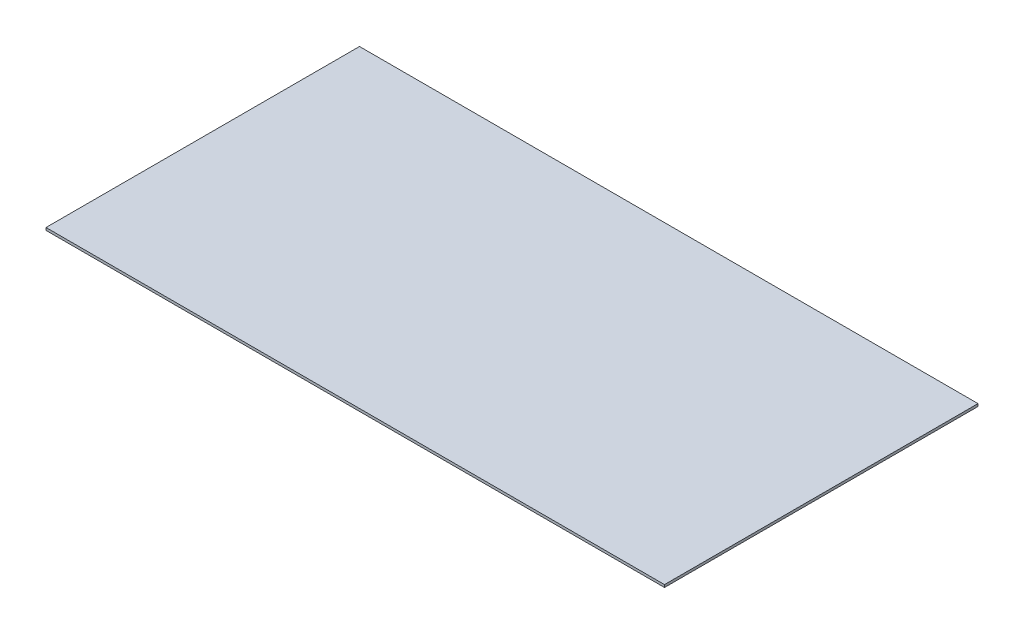
ISO-10303-21;
HEADER;
FILE_DESCRIPTION(('STEP AP214'),'2;1');
FILE_NAME('part.step','',(''),(''),'','','');
FILE_SCHEMA(('AUTOMOTIVE_DESIGN { 1 0 10303 214 1 1 1 1 }'));
ENDSEC;
DATA;
#1=APPLICATION_CONTEXT('core data for automotive mechanical design processes');
#2=APPLICATION_PROTOCOL_DEFINITION('international standard','automotive_design',2000,#1);
#3=PRODUCT_CONTEXT('',#1,'mechanical');
#4=PRODUCT('Part','Part','',(#3));
#5=PRODUCT_RELATED_PRODUCT_CATEGORY('part','',(#4));
#6=PRODUCT_DEFINITION_FORMATION('','',#4);
#7=PRODUCT_DEFINITION_CONTEXT('part definition',#1,'design');
#8=PRODUCT_DEFINITION('design','',#6,#7);
#9=PRODUCT_DEFINITION_SHAPE('','',#8);
#10=(LENGTH_UNIT() NAMED_UNIT(*) SI_UNIT(.MILLI.,.METRE.));
#11=(NAMED_UNIT(*) PLANE_ANGLE_UNIT() SI_UNIT($,.RADIAN.));
#12=(NAMED_UNIT(*) SI_UNIT($,.STERADIAN.) SOLID_ANGLE_UNIT());
#13=UNCERTAINTY_MEASURE_WITH_UNIT(LENGTH_MEASURE(1.E-05),#10,'distance_accuracy_value','');
#14=(GEOMETRIC_REPRESENTATION_CONTEXT(3) GLOBAL_UNCERTAINTY_ASSIGNED_CONTEXT((#13)) GLOBAL_UNIT_ASSIGNED_CONTEXT((#10,
#11,#12)) REPRESENTATION_CONTEXT('',''));
#15=CARTESIAN_POINT('',(0.,0.,0.));
#16=DIRECTION('',(0.,0.,1.));
#17=DIRECTION('',(1.,0.,0.));
#18=AXIS2_PLACEMENT_3D('',#15,#16,#17);
#19=CARTESIAN_POINT('',(365.,3.,185.));
#20=DIRECTION('',(-1.,0.,0.));
#21=DIRECTION('',(0.,0.,1.));
#22=AXIS2_PLACEMENT_3D('',#19,#20,#21);
#23=PLANE('',#22);
#24=DIRECTION('',(0.,0.,-1.));
#25=VECTOR('',#24,1.);
#26=CARTESIAN_POINT('',(365.,0.,185.));
#27=LINE('',#26,#25);
#28=CARTESIAN_POINT('',(365.,0.,185.));
#29=VERTEX_POINT('',#28);
#30=CARTESIAN_POINT('',(365.,0.,-185.));
#31=VERTEX_POINT('',#30);
#32=EDGE_CURVE('E98',#29,#31,#27,.T.);
#33=ORIENTED_EDGE('',*,*,#32,.T.);
#34=DIRECTION('',(0.,-1.,0.));
#35=VECTOR('',#34,1.);
#36=CARTESIAN_POINT('',(365.,3.,-185.));
#37=LINE('',#36,#35);
#38=CARTESIAN_POINT('',(365.,3.,-185.));
#39=VERTEX_POINT('',#38);
#40=EDGE_CURVE('E11',#39,#31,#37,.T.);
#41=ORIENTED_EDGE('',*,*,#40,.F.);
#42=DIRECTION('',(0.,0.,-1.));
#43=VECTOR('',#42,1.);
#44=CARTESIAN_POINT('',(365.,3.,185.));
#45=LINE('',#44,#43);
#46=CARTESIAN_POINT('',(365.,3.,185.));
#47=VERTEX_POINT('',#46);
#48=EDGE_CURVE('E86',#47,#39,#45,.T.);
#49=ORIENTED_EDGE('',*,*,#48,.F.);
#50=DIRECTION('',(0.,-1.,0.));
#51=VECTOR('',#50,1.);
#52=CARTESIAN_POINT('',(365.,3.,185.));
#53=LINE('',#52,#51);
#54=EDGE_CURVE('E94',#47,#29,#53,.T.);
#55=ORIENTED_EDGE('',*,*,#54,.T.);
#56=EDGE_LOOP('',(#33,#41,#49,#55));
#57=FACE_BOUND('',#56,.T.);
#58=ADVANCED_FACE('F35',(#57),#23,.F.);
#59=CARTESIAN_POINT('',(-365.,3.,-185.));
#60=DIRECTION('',(0.,0.,1.));
#61=DIRECTION('',(1.,0.,0.));
#62=AXIS2_PLACEMENT_3D('',#59,#60,#61);
#63=PLANE('',#62);
#64=DIRECTION('',(-1.,0.,0.));
#65=VECTOR('',#64,1.);
#66=CARTESIAN_POINT('',(-365.,0.,-185.));
#67=LINE('',#66,#65);
#68=CARTESIAN_POINT('',(-365.,0.,-185.));
#69=VERTEX_POINT('',#68);
#70=EDGE_CURVE('E90',#31,#69,#67,.T.);
#71=ORIENTED_EDGE('',*,*,#70,.T.);
#72=DIRECTION('',(0.,-1.,0.));
#73=VECTOR('',#72,1.);
#74=CARTESIAN_POINT('',(-365.,3.,-185.));
#75=LINE('',#74,#73);
#76=CARTESIAN_POINT('',(-365.,3.,-185.));
#77=VERTEX_POINT('',#76);
#78=EDGE_CURVE('E43',#77,#69,#75,.T.);
#79=ORIENTED_EDGE('',*,*,#78,.F.);
#80=DIRECTION('',(-1.,0.,0.));
#81=VECTOR('',#80,1.);
#82=CARTESIAN_POINT('',(-365.,3.,-185.));
#83=LINE('',#82,#81);
#84=EDGE_CURVE('E81',#39,#77,#83,.T.);
#85=ORIENTED_EDGE('',*,*,#84,.F.);
#86=ORIENTED_EDGE('',*,*,#40,.T.);
#87=EDGE_LOOP('',(#71,#79,#85,#86));
#88=FACE_BOUND('',#87,.T.);
#89=ADVANCED_FACE('F89',(#88),#63,.F.);
#90=CARTESIAN_POINT('',(-365.,3.,185.));
#91=DIRECTION('',(1.,0.,0.));
#92=DIRECTION('',(0.,0.,-1.));
#93=AXIS2_PLACEMENT_3D('',#90,#91,#92);
#94=PLANE('',#93);
#95=DIRECTION('',(0.,0.,1.));
#96=VECTOR('',#95,1.);
#97=CARTESIAN_POINT('',(-365.,0.,185.));
#98=LINE('',#97,#96);
#99=CARTESIAN_POINT('',(-365.,0.,185.));
#100=VERTEX_POINT('',#99);
#101=EDGE_CURVE('E68',#69,#100,#98,.T.);
#102=ORIENTED_EDGE('',*,*,#101,.T.);
#103=DIRECTION('',(0.,-1.,0.));
#104=VECTOR('',#103,1.);
#105=CARTESIAN_POINT('',(-365.,3.,185.));
#106=LINE('',#105,#104);
#107=CARTESIAN_POINT('',(-365.,3.,185.));
#108=VERTEX_POINT('',#107);
#109=EDGE_CURVE('E91',#108,#100,#106,.T.);
#110=ORIENTED_EDGE('',*,*,#109,.F.);
#111=DIRECTION('',(0.,0.,1.));
#112=VECTOR('',#111,1.);
#113=CARTESIAN_POINT('',(-365.,3.,185.));
#114=LINE('',#113,#112);
#115=EDGE_CURVE('E84',#77,#108,#114,.T.);
#116=ORIENTED_EDGE('',*,*,#115,.F.);
#117=ORIENTED_EDGE('',*,*,#78,.T.);
#118=EDGE_LOOP('',(#102,#110,#116,#117));
#119=FACE_BOUND('',#118,.T.);
#120=ADVANCED_FACE('F92',(#119),#94,.F.);
#121=CARTESIAN_POINT('',(-365.,3.,185.));
#122=DIRECTION('',(0.,0.,-1.));
#123=DIRECTION('',(-1.,0.,0.));
#124=AXIS2_PLACEMENT_3D('',#121,#122,#123);
#125=PLANE('',#124);
#126=DIRECTION('',(1.,0.,0.));
#127=VECTOR('',#126,1.);
#128=CARTESIAN_POINT('',(-365.,0.,185.));
#129=LINE('',#128,#127);
#130=EDGE_CURVE('E74',#100,#29,#129,.T.);
#131=ORIENTED_EDGE('',*,*,#130,.T.);
#132=ORIENTED_EDGE('',*,*,#54,.F.);
#133=DIRECTION('',(1.,0.,0.));
#134=VECTOR('',#133,1.);
#135=CARTESIAN_POINT('',(-365.,3.,185.));
#136=LINE('',#135,#134);
#137=EDGE_CURVE('E51',#108,#47,#136,.T.);
#138=ORIENTED_EDGE('',*,*,#137,.F.);
#139=ORIENTED_EDGE('',*,*,#109,.T.);
#140=EDGE_LOOP('',(#131,#132,#138,#139));
#141=FACE_BOUND('',#140,.T.);
#142=ADVANCED_FACE('F105',(#141),#125,.F.);
#143=CARTESIAN_POINT('',(0.,3.,0.));
#144=DIRECTION('',(0.,-1.,0.));
#145=DIRECTION('',(0.,0.,-1.));
#146=AXIS2_PLACEMENT_3D('',#143,#144,#145);
#147=PLANE('',#146);
#148=ORIENTED_EDGE('',*,*,#48,.T.);
#149=ORIENTED_EDGE('',*,*,#84,.T.);
#150=ORIENTED_EDGE('',*,*,#115,.T.);
#151=ORIENTED_EDGE('',*,*,#137,.T.);
#152=EDGE_LOOP('',(#148,#149,#150,#151));
#153=FACE_BOUND('',#152,.T.);
#154=ADVANCED_FACE('F82',(#153),#147,.F.);
#155=CARTESIAN_POINT('',(0.,0.,0.));
#156=DIRECTION('',(0.,-1.,0.));
#157=DIRECTION('',(0.,0.,-1.));
#158=AXIS2_PLACEMENT_3D('',#155,#156,#157);
#159=PLANE('',#158);
#160=ORIENTED_EDGE('',*,*,#32,.F.);
#161=ORIENTED_EDGE('',*,*,#130,.F.);
#162=ORIENTED_EDGE('',*,*,#101,.F.);
#163=ORIENTED_EDGE('',*,*,#70,.F.);
#164=EDGE_LOOP('',(#160,#161,#162,#163));
#165=FACE_BOUND('',#164,.T.);
#166=ADVANCED_FACE('F108',(#165),#159,.T.);
#167=CLOSED_SHELL('',(#58,#89,#120,#142,#154,#166));
#168=MANIFOLD_SOLID_BREP('B2',#167);
#169=ADVANCED_BREP_SHAPE_REPRESENTATION('',(#18,#168),#14);
#170=SHAPE_DEFINITION_REPRESENTATION(#9,#169);
ENDSEC;
END-ISO-10303-21;
